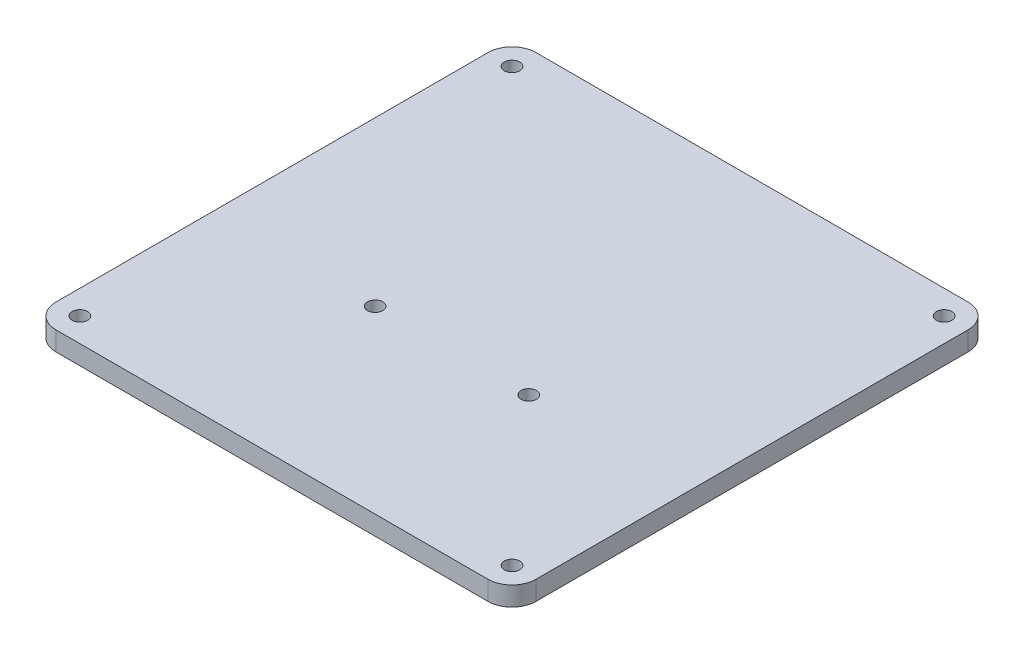
ISO-10303-21;
HEADER;
FILE_DESCRIPTION(('STEP AP214'),'2;1');
FILE_NAME('part.step','',(''),(''),'','','');
FILE_SCHEMA(('AUTOMOTIVE_DESIGN { 1 0 10303 214 1 1 1 1 }'));
ENDSEC;
DATA;
#1=APPLICATION_CONTEXT('core data for automotive mechanical design processes');
#2=APPLICATION_PROTOCOL_DEFINITION('international standard','automotive_design',2000,#1);
#3=PRODUCT_CONTEXT('',#1,'mechanical');
#4=PRODUCT('Part','Part','',(#3));
#5=PRODUCT_RELATED_PRODUCT_CATEGORY('part','',(#4));
#6=PRODUCT_DEFINITION_FORMATION('','',#4);
#7=PRODUCT_DEFINITION_CONTEXT('part definition',#1,'design');
#8=PRODUCT_DEFINITION('design','',#6,#7);
#9=PRODUCT_DEFINITION_SHAPE('','',#8);
#10=(LENGTH_UNIT() NAMED_UNIT(*) SI_UNIT(.MILLI.,.METRE.));
#11=(NAMED_UNIT(*) PLANE_ANGLE_UNIT() SI_UNIT($,.RADIAN.));
#12=(NAMED_UNIT(*) SI_UNIT($,.STERADIAN.) SOLID_ANGLE_UNIT());
#13=UNCERTAINTY_MEASURE_WITH_UNIT(LENGTH_MEASURE(1.E-05),#10,'distance_accuracy_value','');
#14=(GEOMETRIC_REPRESENTATION_CONTEXT(3) GLOBAL_UNCERTAINTY_ASSIGNED_CONTEXT((#13)) GLOBAL_UNIT_ASSIGNED_CONTEXT((#10,
#11,#12)) REPRESENTATION_CONTEXT('',''));
#15=CARTESIAN_POINT('',(0.,0.,0.));
#16=DIRECTION('',(0.,0.,1.));
#17=DIRECTION('',(1.,0.,0.));
#18=AXIS2_PLACEMENT_3D('',#15,#16,#17);
#19=CARTESIAN_POINT('',(0.,4.,0.));
#20=DIRECTION('',(0.,1.,0.));
#21=DIRECTION('',(0.,0.,1.));
#22=AXIS2_PLACEMENT_3D('',#19,#20,#21);
#23=PLANE('',#22);
#24=CARTESIAN_POINT('',(16.,4.,12.5));
#25=DIRECTION('',(0.,1.,0.));
#26=DIRECTION('',(0.,0.,1.));
#27=AXIS2_PLACEMENT_3D('',#24,#25,#26);
#28=CIRCLE('',#27,1.6);
#29=CARTESIAN_POINT('',(16.,4.,14.1));
#30=VERTEX_POINT('',#29);
#31=EDGE_CURVE('E200',#30,#30,#28,.T.);
#32=ORIENTED_EDGE('',*,*,#31,.F.);
#33=EDGE_LOOP('',(#32));
#34=FACE_BOUND('',#33,.T.);
#35=CARTESIAN_POINT('',(45.,4.,45.));
#36=DIRECTION('',(0.,1.,0.));
#37=DIRECTION('',(0.,0.,1.));
#38=AXIS2_PLACEMENT_3D('',#35,#36,#37);
#39=CIRCLE('',#38,1.6);
#40=CARTESIAN_POINT('',(45.,4.,46.6));
#41=VERTEX_POINT('',#40);
#42=EDGE_CURVE('E188',#41,#41,#39,.T.);
#43=ORIENTED_EDGE('',*,*,#42,.F.);
#44=EDGE_LOOP('',(#43));
#45=FACE_BOUND('',#44,.T.);
#46=CARTESIAN_POINT('',(45.,4.,-45.));
#47=DIRECTION('',(0.,1.,0.));
#48=DIRECTION('',(0.,0.,1.));
#49=AXIS2_PLACEMENT_3D('',#46,#47,#48);
#50=CIRCLE('',#49,1.6);
#51=CARTESIAN_POINT('',(45.,4.,-43.4));
#52=VERTEX_POINT('',#51);
#53=EDGE_CURVE('E129',#52,#52,#50,.T.);
#54=ORIENTED_EDGE('',*,*,#53,.F.);
#55=EDGE_LOOP('',(#54));
#56=FACE_BOUND('',#55,.T.);
#57=DIRECTION('',(-1.,0.,0.));
#58=VECTOR('',#57,1.);
#59=CARTESIAN_POINT('',(50.,4.,-50.));
#60=LINE('',#59,#58);
#61=CARTESIAN_POINT('',(45.,4.,-50.));
#62=VERTEX_POINT('',#61);
#63=CARTESIAN_POINT('',(-45.,4.,-50.));
#64=VERTEX_POINT('',#63);
#65=EDGE_CURVE('E138',#62,#64,#60,.T.);
#66=ORIENTED_EDGE('',*,*,#65,.T.);
#67=CARTESIAN_POINT('',(-45.,4.,-45.));
#68=DIRECTION('',(0.,1.,0.));
#69=DIRECTION('',(0.,0.,1.));
#70=AXIS2_PLACEMENT_3D('',#67,#68,#69);
#71=CIRCLE('',#70,5.);
#72=CARTESIAN_POINT('',(-50.,4.,-45.));
#73=VERTEX_POINT('',#72);
#74=EDGE_CURVE('E157',#64,#73,#71,.T.);
#75=ORIENTED_EDGE('',*,*,#74,.T.);
#76=DIRECTION('',(0.,0.,1.));
#77=VECTOR('',#76,1.);
#78=CARTESIAN_POINT('',(-50.,4.,50.));
#79=LINE('',#78,#77);
#80=CARTESIAN_POINT('',(-50.,4.,45.));
#81=VERTEX_POINT('',#80);
#82=EDGE_CURVE('E121',#73,#81,#79,.T.);
#83=ORIENTED_EDGE('',*,*,#82,.T.);
#84=CARTESIAN_POINT('',(-45.,4.,45.));
#85=DIRECTION('',(0.,1.,0.));
#86=DIRECTION('',(0.,0.,1.));
#87=AXIS2_PLACEMENT_3D('',#84,#85,#86);
#88=CIRCLE('',#87,5.);
#89=CARTESIAN_POINT('',(-45.,4.,50.));
#90=VERTEX_POINT('',#89);
#91=EDGE_CURVE('E152',#81,#90,#88,.T.);
#92=ORIENTED_EDGE('',*,*,#91,.T.);
#93=DIRECTION('',(1.,0.,0.));
#94=VECTOR('',#93,1.);
#95=CARTESIAN_POINT('',(50.,4.,50.));
#96=LINE('',#95,#94);
#97=CARTESIAN_POINT('',(45.,4.,50.));
#98=VERTEX_POINT('',#97);
#99=EDGE_CURVE('E168',#90,#98,#96,.T.);
#100=ORIENTED_EDGE('',*,*,#99,.T.);
#101=CARTESIAN_POINT('',(45.,4.,45.));
#102=DIRECTION('',(0.,1.,0.));
#103=DIRECTION('',(0.,0.,1.));
#104=AXIS2_PLACEMENT_3D('',#101,#102,#103);
#105=CIRCLE('',#104,5.);
#106=CARTESIAN_POINT('',(50.,4.,45.));
#107=VERTEX_POINT('',#106);
#108=EDGE_CURVE('E57',#98,#107,#105,.T.);
#109=ORIENTED_EDGE('',*,*,#108,.T.);
#110=DIRECTION('',(0.,0.,-1.));
#111=VECTOR('',#110,1.);
#112=CARTESIAN_POINT('',(50.,4.,50.));
#113=LINE('',#112,#111);
#114=CARTESIAN_POINT('',(50.,4.,-45.));
#115=VERTEX_POINT('',#114);
#116=EDGE_CURVE('E176',#107,#115,#113,.T.);
#117=ORIENTED_EDGE('',*,*,#116,.T.);
#118=CARTESIAN_POINT('',(45.,4.,-45.));
#119=DIRECTION('',(0.,1.,0.));
#120=DIRECTION('',(0.,0.,1.));
#121=AXIS2_PLACEMENT_3D('',#118,#119,#120);
#122=CIRCLE('',#121,5.);
#123=EDGE_CURVE('E155',#115,#62,#122,.T.);
#124=ORIENTED_EDGE('',*,*,#123,.T.);
#125=EDGE_LOOP('',(#66,#75,#83,#92,#100,#109,#117,#124));
#126=FACE_BOUND('',#125,.T.);
#127=CARTESIAN_POINT('',(-45.,4.,-45.));
#128=DIRECTION('',(0.,1.,0.));
#129=DIRECTION('',(0.,0.,1.));
#130=AXIS2_PLACEMENT_3D('',#127,#128,#129);
#131=CIRCLE('',#130,1.6);
#132=CARTESIAN_POINT('',(-45.,4.,-43.4));
#133=VERTEX_POINT('',#132);
#134=EDGE_CURVE('E183',#133,#133,#131,.T.);
#135=ORIENTED_EDGE('',*,*,#134,.F.);
#136=EDGE_LOOP('',(#135));
#137=FACE_BOUND('',#136,.T.);
#138=CARTESIAN_POINT('',(-45.,4.,45.));
#139=DIRECTION('',(0.,1.,0.));
#140=DIRECTION('',(0.,0.,1.));
#141=AXIS2_PLACEMENT_3D('',#138,#139,#140);
#142=CIRCLE('',#141,1.6);
#143=CARTESIAN_POINT('',(-45.,4.,46.6));
#144=VERTEX_POINT('',#143);
#145=EDGE_CURVE('E194',#144,#144,#142,.T.);
#146=ORIENTED_EDGE('',*,*,#145,.F.);
#147=EDGE_LOOP('',(#146));
#148=FACE_BOUND('',#147,.T.);
#149=CARTESIAN_POINT('',(-16.,4.,12.5));
#150=DIRECTION('',(0.,1.,0.));
#151=DIRECTION('',(0.,0.,-1.));
#152=AXIS2_PLACEMENT_3D('',#149,#150,#151);
#153=CIRCLE('',#152,1.6);
#154=CARTESIAN_POINT('',(-16.,4.,10.9));
#155=VERTEX_POINT('',#154);
#156=EDGE_CURVE('E206',#155,#155,#153,.T.);
#157=ORIENTED_EDGE('',*,*,#156,.F.);
#158=EDGE_LOOP('',(#157));
#159=FACE_BOUND('',#158,.T.);
#160=ADVANCED_FACE('F35',(#34,#45,#56,#126,#137,#148,#159),#23,.T.);
#161=CARTESIAN_POINT('',(0.,0.,0.));
#162=DIRECTION('',(0.,1.,0.));
#163=DIRECTION('',(0.,0.,1.));
#164=AXIS2_PLACEMENT_3D('',#161,#162,#163);
#165=PLANE('',#164);
#166=DIRECTION('',(0.,0.,1.));
#167=VECTOR('',#166,1.);
#168=CARTESIAN_POINT('',(-50.,0.,50.));
#169=LINE('',#168,#167);
#170=CARTESIAN_POINT('',(-50.,0.,-45.));
#171=VERTEX_POINT('',#170);
#172=CARTESIAN_POINT('',(-50.,0.,45.));
#173=VERTEX_POINT('',#172);
#174=EDGE_CURVE('E118',#171,#173,#169,.T.);
#175=ORIENTED_EDGE('',*,*,#174,.F.);
#176=CARTESIAN_POINT('',(-45.,0.,-45.));
#177=DIRECTION('',(0.,1.,0.));
#178=DIRECTION('',(0.,0.,1.));
#179=AXIS2_PLACEMENT_3D('',#176,#177,#178);
#180=CIRCLE('',#179,5.);
#181=CARTESIAN_POINT('',(-45.,0.,-50.));
#182=VERTEX_POINT('',#181);
#183=EDGE_CURVE('E101',#171,#182,#180,.F.);
#184=ORIENTED_EDGE('',*,*,#183,.T.);
#185=DIRECTION('',(-1.,0.,0.));
#186=VECTOR('',#185,1.);
#187=CARTESIAN_POINT('',(50.,0.,-50.));
#188=LINE('',#187,#186);
#189=CARTESIAN_POINT('',(45.,0.,-50.));
#190=VERTEX_POINT('',#189);
#191=EDGE_CURVE('E142',#190,#182,#188,.T.);
#192=ORIENTED_EDGE('',*,*,#191,.F.);
#193=CARTESIAN_POINT('',(45.,0.,-45.));
#194=DIRECTION('',(0.,1.,0.));
#195=DIRECTION('',(0.,0.,1.));
#196=AXIS2_PLACEMENT_3D('',#193,#194,#195);
#197=CIRCLE('',#196,5.);
#198=CARTESIAN_POINT('',(50.,0.,-45.));
#199=VERTEX_POINT('',#198);
#200=EDGE_CURVE('E112',#190,#199,#197,.F.);
#201=ORIENTED_EDGE('',*,*,#200,.T.);
#202=DIRECTION('',(0.,0.,-1.));
#203=VECTOR('',#202,1.);
#204=CARTESIAN_POINT('',(50.,0.,50.));
#205=LINE('',#204,#203);
#206=CARTESIAN_POINT('',(50.,0.,45.));
#207=VERTEX_POINT('',#206);
#208=EDGE_CURVE('E132',#207,#199,#205,.T.);
#209=ORIENTED_EDGE('',*,*,#208,.F.);
#210=CARTESIAN_POINT('',(45.,0.,45.));
#211=DIRECTION('',(0.,1.,0.));
#212=DIRECTION('',(0.,0.,1.));
#213=AXIS2_PLACEMENT_3D('',#210,#211,#212);
#214=CIRCLE('',#213,5.);
#215=CARTESIAN_POINT('',(45.,0.,50.));
#216=VERTEX_POINT('',#215);
#217=EDGE_CURVE('E146',#207,#216,#214,.F.);
#218=ORIENTED_EDGE('',*,*,#217,.T.);
#219=DIRECTION('',(1.,0.,0.));
#220=VECTOR('',#219,1.);
#221=CARTESIAN_POINT('',(50.,0.,50.));
#222=LINE('',#221,#220);
#223=CARTESIAN_POINT('',(-45.,0.,50.));
#224=VERTEX_POINT('',#223);
#225=EDGE_CURVE('E128',#224,#216,#222,.T.);
#226=ORIENTED_EDGE('',*,*,#225,.F.);
#227=CARTESIAN_POINT('',(-45.,0.,45.));
#228=DIRECTION('',(0.,1.,0.));
#229=DIRECTION('',(0.,0.,1.));
#230=AXIS2_PLACEMENT_3D('',#227,#228,#229);
#231=CIRCLE('',#230,5.);
#232=EDGE_CURVE('E122',#224,#173,#231,.F.);
#233=ORIENTED_EDGE('',*,*,#232,.T.);
#234=EDGE_LOOP('',(#175,#184,#192,#201,#209,#218,#226,#233));
#235=FACE_BOUND('',#234,.T.);
#236=CARTESIAN_POINT('',(45.,0.,-45.));
#237=DIRECTION('',(0.,1.,0.));
#238=DIRECTION('',(0.,0.,1.));
#239=AXIS2_PLACEMENT_3D('',#236,#237,#238);
#240=CIRCLE('',#239,1.6);
#241=CARTESIAN_POINT('',(45.,0.,-43.4));
#242=VERTEX_POINT('',#241);
#243=EDGE_CURVE('E135',#242,#242,#240,.T.);
#244=ORIENTED_EDGE('',*,*,#243,.T.);
#245=EDGE_LOOP('',(#244));
#246=FACE_BOUND('',#245,.T.);
#247=CARTESIAN_POINT('',(-45.,0.,-45.));
#248=DIRECTION('',(0.,1.,0.));
#249=DIRECTION('',(0.,0.,1.));
#250=AXIS2_PLACEMENT_3D('',#247,#248,#249);
#251=CIRCLE('',#250,1.6);
#252=CARTESIAN_POINT('',(-45.,0.,-43.4));
#253=VERTEX_POINT('',#252);
#254=EDGE_CURVE('E185',#253,#253,#251,.T.);
#255=ORIENTED_EDGE('',*,*,#254,.T.);
#256=EDGE_LOOP('',(#255));
#257=FACE_BOUND('',#256,.T.);
#258=CARTESIAN_POINT('',(45.,0.,45.));
#259=DIRECTION('',(0.,1.,0.));
#260=DIRECTION('',(0.,0.,1.));
#261=AXIS2_PLACEMENT_3D('',#258,#259,#260);
#262=CIRCLE('',#261,1.6);
#263=CARTESIAN_POINT('',(45.,0.,46.6));
#264=VERTEX_POINT('',#263);
#265=EDGE_CURVE('E191',#264,#264,#262,.T.);
#266=ORIENTED_EDGE('',*,*,#265,.T.);
#267=EDGE_LOOP('',(#266));
#268=FACE_BOUND('',#267,.T.);
#269=CARTESIAN_POINT('',(-45.,0.,45.));
#270=DIRECTION('',(0.,1.,0.));
#271=DIRECTION('',(0.,0.,1.));
#272=AXIS2_PLACEMENT_3D('',#269,#270,#271);
#273=CIRCLE('',#272,1.6);
#274=CARTESIAN_POINT('',(-45.,0.,46.6));
#275=VERTEX_POINT('',#274);
#276=EDGE_CURVE('E197',#275,#275,#273,.T.);
#277=ORIENTED_EDGE('',*,*,#276,.T.);
#278=EDGE_LOOP('',(#277));
#279=FACE_BOUND('',#278,.T.);
#280=CARTESIAN_POINT('',(16.,0.,12.5));
#281=DIRECTION('',(0.,1.,0.));
#282=DIRECTION('',(0.,0.,1.));
#283=AXIS2_PLACEMENT_3D('',#280,#281,#282);
#284=CIRCLE('',#283,1.6);
#285=CARTESIAN_POINT('',(16.,0.,14.1));
#286=VERTEX_POINT('',#285);
#287=EDGE_CURVE('E203',#286,#286,#284,.T.);
#288=ORIENTED_EDGE('',*,*,#287,.T.);
#289=EDGE_LOOP('',(#288));
#290=FACE_BOUND('',#289,.T.);
#291=CARTESIAN_POINT('',(-16.,0.,12.5));
#292=DIRECTION('',(0.,1.,0.));
#293=DIRECTION('',(0.,0.,-1.));
#294=AXIS2_PLACEMENT_3D('',#291,#292,#293);
#295=CIRCLE('',#294,1.6);
#296=CARTESIAN_POINT('',(-16.,0.,10.9));
#297=VERTEX_POINT('',#296);
#298=EDGE_CURVE('E209',#297,#297,#295,.T.);
#299=ORIENTED_EDGE('',*,*,#298,.T.);
#300=EDGE_LOOP('',(#299));
#301=FACE_BOUND('',#300,.T.);
#302=ADVANCED_FACE('F125',(#235,#246,#257,#268,#279,#290,#301),#165,.F.);
#303=CARTESIAN_POINT('',(-50.,4.,50.));
#304=DIRECTION('',(1.,0.,0.));
#305=DIRECTION('',(0.,0.,-1.));
#306=AXIS2_PLACEMENT_3D('',#303,#304,#305);
#307=PLANE('',#306);
#308=ORIENTED_EDGE('',*,*,#82,.F.);
#309=DIRECTION('',(0.,-1.,0.));
#310=VECTOR('',#309,1.);
#311=CARTESIAN_POINT('',(-50.,4.,-45.));
#312=LINE('',#311,#310);
#313=EDGE_CURVE('E105',#73,#171,#312,.T.);
#314=ORIENTED_EDGE('',*,*,#313,.T.);
#315=ORIENTED_EDGE('',*,*,#174,.T.);
#316=DIRECTION('',(0.,-1.,0.));
#317=VECTOR('',#316,1.);
#318=CARTESIAN_POINT('',(-50.,4.,45.));
#319=LINE('',#318,#317);
#320=EDGE_CURVE('E123',#173,#81,#319,.F.);
#321=ORIENTED_EDGE('',*,*,#320,.T.);
#322=EDGE_LOOP('',(#308,#314,#315,#321));
#323=FACE_BOUND('',#322,.T.);
#324=ADVANCED_FACE('F117',(#323),#307,.F.);
#325=CARTESIAN_POINT('',(50.,4.,50.));
#326=DIRECTION('',(0.,0.,-1.));
#327=DIRECTION('',(-1.,0.,0.));
#328=AXIS2_PLACEMENT_3D('',#325,#326,#327);
#329=PLANE('',#328);
#330=ORIENTED_EDGE('',*,*,#225,.T.);
#331=DIRECTION('',(0.,-1.,0.));
#332=VECTOR('',#331,1.);
#333=CARTESIAN_POINT('',(45.,4.,50.));
#334=LINE('',#333,#332);
#335=EDGE_CURVE('E11',#216,#98,#334,.F.);
#336=ORIENTED_EDGE('',*,*,#335,.T.);
#337=ORIENTED_EDGE('',*,*,#99,.F.);
#338=DIRECTION('',(0.,-1.,0.));
#339=VECTOR('',#338,1.);
#340=CARTESIAN_POINT('',(-45.,4.,50.));
#341=LINE('',#340,#339);
#342=EDGE_CURVE('E43',#90,#224,#341,.T.);
#343=ORIENTED_EDGE('',*,*,#342,.T.);
#344=EDGE_LOOP('',(#330,#336,#337,#343));
#345=FACE_BOUND('',#344,.T.);
#346=ADVANCED_FACE('F166',(#345),#329,.F.);
#347=CARTESIAN_POINT('',(50.,4.,50.));
#348=DIRECTION('',(-1.,0.,0.));
#349=DIRECTION('',(0.,0.,1.));
#350=AXIS2_PLACEMENT_3D('',#347,#348,#349);
#351=PLANE('',#350);
#352=ORIENTED_EDGE('',*,*,#208,.T.);
#353=DIRECTION('',(0.,-1.,0.));
#354=VECTOR('',#353,1.);
#355=CARTESIAN_POINT('',(50.,4.,-45.));
#356=LINE('',#355,#354);
#357=EDGE_CURVE('E50',#199,#115,#356,.F.);
#358=ORIENTED_EDGE('',*,*,#357,.T.);
#359=ORIENTED_EDGE('',*,*,#116,.F.);
#360=DIRECTION('',(0.,-1.,0.));
#361=VECTOR('',#360,1.);
#362=CARTESIAN_POINT('',(50.,4.,45.));
#363=LINE('',#362,#361);
#364=EDGE_CURVE('E159',#107,#207,#363,.T.);
#365=ORIENTED_EDGE('',*,*,#364,.T.);
#366=EDGE_LOOP('',(#352,#358,#359,#365));
#367=FACE_BOUND('',#366,.T.);
#368=ADVANCED_FACE('F175',(#367),#351,.F.);
#369=CARTESIAN_POINT('',(50.,4.,-50.));
#370=DIRECTION('',(0.,0.,1.));
#371=DIRECTION('',(1.,0.,0.));
#372=AXIS2_PLACEMENT_3D('',#369,#370,#371);
#373=PLANE('',#372);
#374=ORIENTED_EDGE('',*,*,#191,.T.);
#375=DIRECTION('',(0.,-1.,0.));
#376=VECTOR('',#375,1.);
#377=CARTESIAN_POINT('',(-45.,4.,-50.));
#378=LINE('',#377,#376);
#379=EDGE_CURVE('E106',#182,#64,#378,.F.);
#380=ORIENTED_EDGE('',*,*,#379,.T.);
#381=ORIENTED_EDGE('',*,*,#65,.F.);
#382=DIRECTION('',(0.,-1.,0.));
#383=VECTOR('',#382,1.);
#384=CARTESIAN_POINT('',(45.,4.,-50.));
#385=LINE('',#384,#383);
#386=EDGE_CURVE('E111',#62,#190,#385,.T.);
#387=ORIENTED_EDGE('',*,*,#386,.T.);
#388=EDGE_LOOP('',(#374,#380,#381,#387));
#389=FACE_BOUND('',#388,.T.);
#390=ADVANCED_FACE('F231',(#389),#373,.F.);
#391=CARTESIAN_POINT('',(45.,4.,-45.));
#392=DIRECTION('',(0.,-1.,0.));
#393=DIRECTION('',(0.,0.,-1.));
#394=AXIS2_PLACEMENT_3D('',#391,#392,#393);
#395=CYLINDRICAL_SURFACE('',#394,1.6);
#396=ORIENTED_EDGE('',*,*,#53,.T.);
#397=EDGE_LOOP('',(#396));
#398=FACE_BOUND('',#397,.T.);
#399=ORIENTED_EDGE('',*,*,#243,.F.);
#400=EDGE_LOOP('',(#399));
#401=FACE_BOUND('',#400,.T.);
#402=ADVANCED_FACE('F228',(#398,#401),#395,.F.);
#403=CARTESIAN_POINT('',(-45.,4.,-45.));
#404=DIRECTION('',(0.,-1.,0.));
#405=DIRECTION('',(0.,0.,-1.));
#406=AXIS2_PLACEMENT_3D('',#403,#404,#405);
#407=CYLINDRICAL_SURFACE('',#406,1.6);
#408=ORIENTED_EDGE('',*,*,#134,.T.);
#409=EDGE_LOOP('',(#408));
#410=FACE_BOUND('',#409,.T.);
#411=ORIENTED_EDGE('',*,*,#254,.F.);
#412=EDGE_LOOP('',(#411));
#413=FACE_BOUND('',#412,.T.);
#414=ADVANCED_FACE('F280',(#410,#413),#407,.F.);
#415=CARTESIAN_POINT('',(45.,4.,45.));
#416=DIRECTION('',(0.,-1.,0.));
#417=DIRECTION('',(0.,0.,-1.));
#418=AXIS2_PLACEMENT_3D('',#415,#416,#417);
#419=CYLINDRICAL_SURFACE('',#418,1.6);
#420=ORIENTED_EDGE('',*,*,#42,.T.);
#421=EDGE_LOOP('',(#420));
#422=FACE_BOUND('',#421,.T.);
#423=ORIENTED_EDGE('',*,*,#265,.F.);
#424=EDGE_LOOP('',(#423));
#425=FACE_BOUND('',#424,.T.);
#426=ADVANCED_FACE('F263',(#422,#425),#419,.F.);
#427=CARTESIAN_POINT('',(-45.,4.,45.));
#428=DIRECTION('',(0.,-1.,0.));
#429=DIRECTION('',(0.,0.,-1.));
#430=AXIS2_PLACEMENT_3D('',#427,#428,#429);
#431=CYLINDRICAL_SURFACE('',#430,1.6);
#432=ORIENTED_EDGE('',*,*,#145,.T.);
#433=EDGE_LOOP('',(#432));
#434=FACE_BOUND('',#433,.T.);
#435=ORIENTED_EDGE('',*,*,#276,.F.);
#436=EDGE_LOOP('',(#435));
#437=FACE_BOUND('',#436,.T.);
#438=ADVANCED_FACE('F259',(#434,#437),#431,.F.);
#439=CARTESIAN_POINT('',(16.,4.,12.5));
#440=DIRECTION('',(0.,-1.,0.));
#441=DIRECTION('',(0.,0.,-1.));
#442=AXIS2_PLACEMENT_3D('',#439,#440,#441);
#443=CYLINDRICAL_SURFACE('',#442,1.6);
#444=ORIENTED_EDGE('',*,*,#31,.T.);
#445=EDGE_LOOP('',(#444));
#446=FACE_BOUND('',#445,.T.);
#447=ORIENTED_EDGE('',*,*,#287,.F.);
#448=EDGE_LOOP('',(#447));
#449=FACE_BOUND('',#448,.T.);
#450=ADVANCED_FACE('F262',(#446,#449),#443,.F.);
#451=CARTESIAN_POINT('',(-16.,4.,12.5));
#452=DIRECTION('',(0.,-1.,0.));
#453=DIRECTION('',(0.,0.,-1.));
#454=AXIS2_PLACEMENT_3D('',#451,#452,#453);
#455=CYLINDRICAL_SURFACE('',#454,1.6);
#456=ORIENTED_EDGE('',*,*,#156,.T.);
#457=EDGE_LOOP('',(#456));
#458=FACE_BOUND('',#457,.T.);
#459=ORIENTED_EDGE('',*,*,#298,.F.);
#460=EDGE_LOOP('',(#459));
#461=FACE_BOUND('',#460,.T.);
#462=ADVANCED_FACE('F215',(#458,#461),#455,.F.);
#463=CARTESIAN_POINT('',(-45.,4.,-45.));
#464=DIRECTION('',(0.,-1.,0.));
#465=DIRECTION('',(0.,0.,-1.));
#466=AXIS2_PLACEMENT_3D('',#463,#464,#465);
#467=CYLINDRICAL_SURFACE('',#466,5.);
#468=ORIENTED_EDGE('',*,*,#74,.F.);
#469=ORIENTED_EDGE('',*,*,#379,.F.);
#470=ORIENTED_EDGE('',*,*,#183,.F.);
#471=ORIENTED_EDGE('',*,*,#313,.F.);
#472=EDGE_LOOP('',(#468,#469,#470,#471));
#473=FACE_BOUND('',#472,.T.);
#474=ADVANCED_FACE('F104',(#473),#467,.T.);
#475=CARTESIAN_POINT('',(45.,4.,-45.));
#476=DIRECTION('',(0.,-1.,0.));
#477=DIRECTION('',(0.,0.,-1.));
#478=AXIS2_PLACEMENT_3D('',#475,#476,#477);
#479=CYLINDRICAL_SURFACE('',#478,5.);
#480=ORIENTED_EDGE('',*,*,#123,.F.);
#481=ORIENTED_EDGE('',*,*,#357,.F.);
#482=ORIENTED_EDGE('',*,*,#200,.F.);
#483=ORIENTED_EDGE('',*,*,#386,.F.);
#484=EDGE_LOOP('',(#480,#481,#482,#483));
#485=FACE_BOUND('',#484,.T.);
#486=ADVANCED_FACE('F243',(#485),#479,.T.);
#487=CARTESIAN_POINT('',(45.,4.,45.));
#488=DIRECTION('',(0.,-1.,0.));
#489=DIRECTION('',(0.,0.,-1.));
#490=AXIS2_PLACEMENT_3D('',#487,#488,#489);
#491=CYLINDRICAL_SURFACE('',#490,5.);
#492=ORIENTED_EDGE('',*,*,#108,.F.);
#493=ORIENTED_EDGE('',*,*,#335,.F.);
#494=ORIENTED_EDGE('',*,*,#217,.F.);
#495=ORIENTED_EDGE('',*,*,#364,.F.);
#496=EDGE_LOOP('',(#492,#493,#494,#495));
#497=FACE_BOUND('',#496,.T.);
#498=ADVANCED_FACE('F174',(#497),#491,.T.);
#499=CARTESIAN_POINT('',(-45.,4.,45.));
#500=DIRECTION('',(0.,-1.,0.));
#501=DIRECTION('',(0.,0.,-1.));
#502=AXIS2_PLACEMENT_3D('',#499,#500,#501);
#503=CYLINDRICAL_SURFACE('',#502,5.);
#504=ORIENTED_EDGE('',*,*,#91,.F.);
#505=ORIENTED_EDGE('',*,*,#320,.F.);
#506=ORIENTED_EDGE('',*,*,#232,.F.);
#507=ORIENTED_EDGE('',*,*,#342,.F.);
#508=EDGE_LOOP('',(#504,#505,#506,#507));
#509=FACE_BOUND('',#508,.T.);
#510=ADVANCED_FACE('F37',(#509),#503,.T.);
#511=CLOSED_SHELL('',(#160,#302,#324,#346,#368,#390,#402,#414,#426,#438,#450,#462,#474,#486,
#498,#510));
#512=MANIFOLD_SOLID_BREP('B2',#511);
#513=ADVANCED_BREP_SHAPE_REPRESENTATION('',(#18,#512),#14);
#514=SHAPE_DEFINITION_REPRESENTATION(#9,#513);
ENDSEC;
END-ISO-10303-21;
